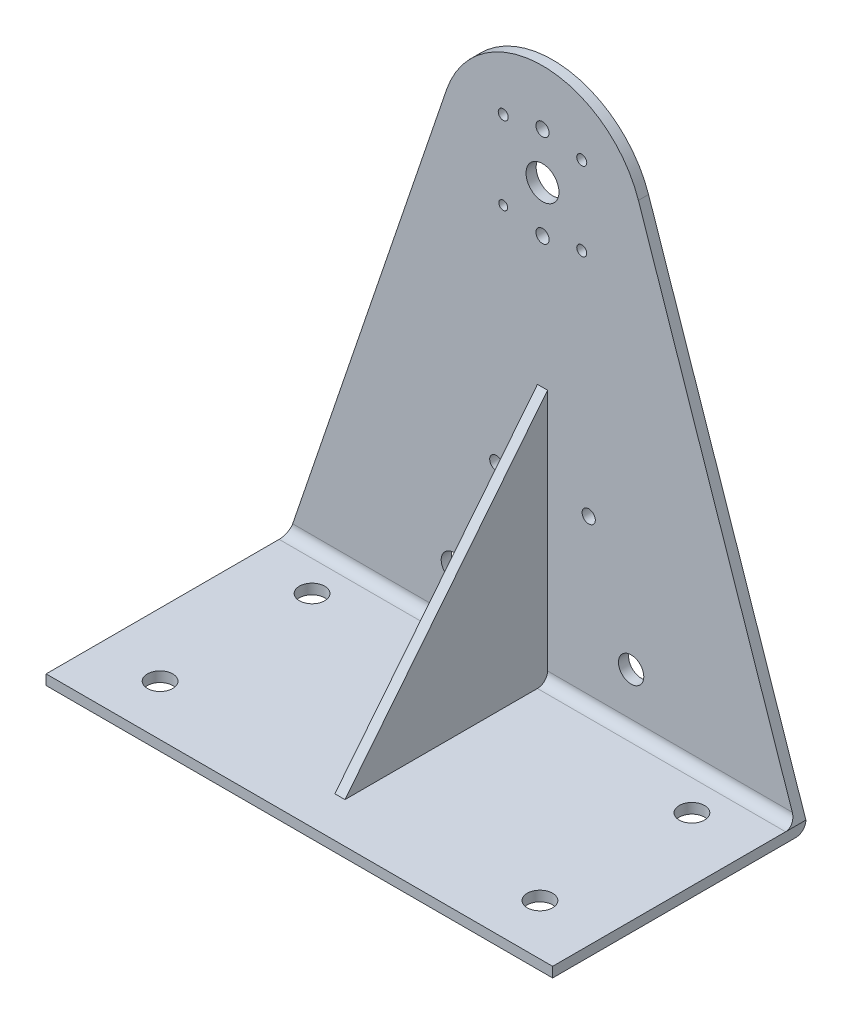
ISO-10303-21;
HEADER;
FILE_DESCRIPTION(('STEP AP214'),'2;1');
FILE_NAME('part.step','',(''),(''),'','','');
FILE_SCHEMA(('AUTOMOTIVE_DESIGN { 1 0 10303 214 1 1 1 1 }'));
ENDSEC;
DATA;
#1=APPLICATION_CONTEXT('core data for automotive mechanical design processes');
#2=APPLICATION_PROTOCOL_DEFINITION('international standard','automotive_design',2000,#1);
#3=PRODUCT_CONTEXT('',#1,'mechanical');
#4=PRODUCT('Part','Part','',(#3));
#5=PRODUCT_RELATED_PRODUCT_CATEGORY('part','',(#4));
#6=PRODUCT_DEFINITION_FORMATION('','',#4);
#7=PRODUCT_DEFINITION_CONTEXT('part definition',#1,'design');
#8=PRODUCT_DEFINITION('design','',#6,#7);
#9=PRODUCT_DEFINITION_SHAPE('','',#8);
#10=(LENGTH_UNIT() NAMED_UNIT(*) SI_UNIT(.MILLI.,.METRE.));
#11=(NAMED_UNIT(*) PLANE_ANGLE_UNIT() SI_UNIT($,.RADIAN.));
#12=(NAMED_UNIT(*) SI_UNIT($,.STERADIAN.) SOLID_ANGLE_UNIT());
#13=UNCERTAINTY_MEASURE_WITH_UNIT(LENGTH_MEASURE(1.E-05),#10,'distance_accuracy_value','');
#14=(GEOMETRIC_REPRESENTATION_CONTEXT(3) GLOBAL_UNCERTAINTY_ASSIGNED_CONTEXT((#13)) GLOBAL_UNIT_ASSIGNED_CONTEXT((#10,
#11,#12)) REPRESENTATION_CONTEXT('',''));
#15=CARTESIAN_POINT('',(0.,0.,0.));
#16=DIRECTION('',(0.,0.,1.));
#17=DIRECTION('',(1.,0.,0.));
#18=AXIS2_PLACEMENT_3D('',#15,#16,#17);
#19=CARTESIAN_POINT('',(100.,4.,8.00000000000001));
#20=DIRECTION('',(1.,0.,0.));
#21=DIRECTION('',(0.,0.,-1.));
#22=AXIS2_PLACEMENT_3D('',#19,#20,#21);
#23=CYLINDRICAL_SURFACE('',#22,4.);
#24=CARTESIAN_POINT('',(2.,4.,8.00000000000001));
#25=DIRECTION('',(-1.,0.,0.));
#26=DIRECTION('',(0.,0.,1.));
#27=AXIS2_PLACEMENT_3D('',#24,#25,#26);
#28=CIRCLE('',#27,4.);
#29=CARTESIAN_POINT('',(2.,0.,8.00000000000001));
#30=VERTEX_POINT('',#29);
#31=CARTESIAN_POINT('',(2.,4.,4.00000000000001));
#32=VERTEX_POINT('',#31);
#33=EDGE_CURVE('E119',#30,#32,#28,.F.);
#34=ORIENTED_EDGE('',*,*,#33,.F.);
#35=DIRECTION('',(-1.,0.,0.));
#36=VECTOR('',#35,1.);
#37=CARTESIAN_POINT('',(-100.,0.,8.00000000000001));
#38=LINE('',#37,#36);
#39=CARTESIAN_POINT('',(100.,0.,8.00000000000001));
#40=VERTEX_POINT('',#39);
#41=EDGE_CURVE('E207',#40,#30,#38,.T.);
#42=ORIENTED_EDGE('',*,*,#41,.F.);
#43=CARTESIAN_POINT('',(98.641067130598,4.,8.00000000000001));
#44=DIRECTION('',(-0.946849703262405,-0.321676296036708,0.));
#45=DIRECTION('',(0.321676296036708,-0.946849703262405,0.));
#46=AXIS2_PLACEMENT_3D('',#43,#44,#45);
#47=ELLIPSE('',#46,4.2245353050414,4.);
#48=CARTESIAN_POINT('',(98.641067130598,4.,4.));
#49=VERTEX_POINT('',#48);
#50=EDGE_CURVE('E204',#49,#40,#47,.T.);
#51=ORIENTED_EDGE('',*,*,#50,.F.);
#52=DIRECTION('',(-1.,0.,0.));
#53=VECTOR('',#52,1.);
#54=CARTESIAN_POINT('',(100.,4.,4.));
#55=LINE('',#54,#53);
#56=EDGE_CURVE('E199',#32,#49,#55,.F.);
#57=ORIENTED_EDGE('',*,*,#56,.F.);
#58=EDGE_LOOP('',(#34,#42,#51,#57));
#59=FACE_BOUND('',#58,.T.);
#60=ADVANCED_FACE('F110',(#59),#23,.F.);
#61=CARTESIAN_POINT('',(0.,0.,0.));
#62=DIRECTION('',(0.,0.,1.));
#63=DIRECTION('',(1.,0.,0.));
#64=AXIS2_PLACEMENT_3D('',#61,#62,#63);
#65=PLANE('',#64);
#66=CARTESIAN_POINT('',(-15.5,154.5,0.));
#67=DIRECTION('',(0.,0.,1.));
#68=DIRECTION('',(1.,0.,0.));
#69=AXIS2_PLACEMENT_3D('',#66,#67,#68);
#70=CIRCLE('',#69,1.75);
#71=CARTESIAN_POINT('',(-13.75,154.5,0.));
#72=VERTEX_POINT('',#71);
#73=EDGE_CURVE('E513',#72,#72,#70,.T.);
#74=ORIENTED_EDGE('',*,*,#73,.T.);
#75=EDGE_LOOP('',(#74));
#76=FACE_BOUND('',#75,.T.);
#77=CARTESIAN_POINT('',(15.5,154.5,0.));
#78=DIRECTION('',(0.,0.,1.));
#79=DIRECTION('',(1.,0.,0.));
#80=AXIS2_PLACEMENT_3D('',#77,#78,#79);
#81=CIRCLE('',#80,1.97872079457994);
#82=CARTESIAN_POINT('',(17.4787207945799,154.5,0.));
#83=VERTEX_POINT('',#82);
#84=EDGE_CURVE('E509',#83,#83,#81,.T.);
#85=ORIENTED_EDGE('',*,*,#84,.T.);
#86=EDGE_LOOP('',(#85));
#87=FACE_BOUND('',#86,.T.);
#88=CARTESIAN_POINT('',(15.5,185.5,0.));
#89=DIRECTION('',(0.,0.,1.));
#90=DIRECTION('',(1.,0.,0.));
#91=AXIS2_PLACEMENT_3D('',#88,#89,#90);
#92=CIRCLE('',#91,1.97872079457994);
#93=CARTESIAN_POINT('',(17.4787207945799,185.5,0.));
#94=VERTEX_POINT('',#93);
#95=EDGE_CURVE('E507',#94,#94,#92,.T.);
#96=ORIENTED_EDGE('',*,*,#95,.T.);
#97=EDGE_LOOP('',(#96));
#98=FACE_BOUND('',#97,.T.);
#99=CARTESIAN_POINT('',(-15.5,185.5,0.));
#100=DIRECTION('',(0.,0.,1.));
#101=DIRECTION('',(1.,0.,0.));
#102=AXIS2_PLACEMENT_3D('',#99,#100,#101);
#103=CIRCLE('',#102,1.97872079457994);
#104=CARTESIAN_POINT('',(-13.5212792054201,185.5,0.));
#105=VERTEX_POINT('',#104);
#106=EDGE_CURVE('E510',#105,#105,#103,.T.);
#107=ORIENTED_EDGE('',*,*,#106,.T.);
#108=EDGE_LOOP('',(#107));
#109=FACE_BOUND('',#108,.T.);
#110=CARTESIAN_POINT('',(-35.,21.,0.));
#111=DIRECTION('',(0.,0.,1.));
#112=DIRECTION('',(1.,0.,0.));
#113=AXIS2_PLACEMENT_3D('',#110,#111,#112);
#114=CIRCLE('',#113,5.);
#115=CARTESIAN_POINT('',(-30.,21.,0.));
#116=VERTEX_POINT('',#115);
#117=EDGE_CURVE('E237',#116,#116,#114,.T.);
#118=ORIENTED_EDGE('',*,*,#117,.T.);
#119=EDGE_LOOP('',(#118));
#120=FACE_BOUND('',#119,.T.);
#121=CARTESIAN_POINT('',(35.,21.,0.));
#122=DIRECTION('',(0.,0.,1.));
#123=DIRECTION('',(1.,0.,0.));
#124=AXIS2_PLACEMENT_3D('',#121,#122,#123);
#125=CIRCLE('',#124,5.);
#126=CARTESIAN_POINT('',(40.,21.,0.));
#127=VERTEX_POINT('',#126);
#128=EDGE_CURVE('E526',#127,#127,#125,.T.);
#129=ORIENTED_EDGE('',*,*,#128,.T.);
#130=EDGE_LOOP('',(#129));
#131=FACE_BOUND('',#130,.T.);
#132=CARTESIAN_POINT('',(18.25,65.,0.));
#133=DIRECTION('',(0.,0.,-1.));
#134=DIRECTION('',(-1.,0.,0.));
#135=AXIS2_PLACEMENT_3D('',#132,#133,#134);
#136=CIRCLE('',#135,2.6);
#137=CARTESIAN_POINT('',(15.65,65.,0.));
#138=VERTEX_POINT('',#137);
#139=EDGE_CURVE('E226',#138,#138,#136,.T.);
#140=ORIENTED_EDGE('',*,*,#139,.F.);
#141=EDGE_LOOP('',(#140));
#142=FACE_BOUND('',#141,.T.);
#143=CARTESIAN_POINT('',(-18.25,65.,0.));
#144=DIRECTION('',(0.,0.,-1.));
#145=DIRECTION('',(-1.,0.,0.));
#146=AXIS2_PLACEMENT_3D('',#143,#144,#145);
#147=CIRCLE('',#146,2.6);
#148=CARTESIAN_POINT('',(-20.85,65.,0.));
#149=VERTEX_POINT('',#148);
#150=EDGE_CURVE('E232',#149,#149,#147,.T.);
#151=ORIENTED_EDGE('',*,*,#150,.F.);
#152=EDGE_LOOP('',(#151));
#153=FACE_BOUND('',#152,.T.);
#154=DIRECTION('',(-1.,0.,0.));
#155=VECTOR('',#154,1.);
#156=CARTESIAN_POINT('',(-100.,0.,0.));
#157=LINE('',#156,#155);
#158=CARTESIAN_POINT('',(100.,0.,0.));
#159=VERTEX_POINT('',#158);
#160=CARTESIAN_POINT('',(-100.,0.,0.));
#161=VERTEX_POINT('',#160);
#162=EDGE_CURVE('E336',#159,#161,#157,.T.);
#163=ORIENTED_EDGE('',*,*,#162,.T.);
#164=DIRECTION('',(0.321676296036708,0.946849703262405,0.));
#165=VECTOR('',#164,1.);
#166=CARTESIAN_POINT('',(-89.6524360568104,30.4579105448907,0.));
#167=LINE('',#166,#165);
#168=CARTESIAN_POINT('',(-37.8739881304963,182.867051841468,0.));
#169=VERTEX_POINT('',#168);
#170=EDGE_CURVE('E306',#161,#169,#167,.T.);
#171=ORIENTED_EDGE('',*,*,#170,.T.);
#172=CARTESIAN_POINT('',(0.,170.,0.));
#173=DIRECTION('',(0.,0.,1.));
#174=DIRECTION('',(1.,0.,0.));
#175=AXIS2_PLACEMENT_3D('',#172,#173,#174);
#176=CIRCLE('',#175,40.);
#177=CARTESIAN_POINT('',(37.8739881304963,182.867051841468,0.));
#178=VERTEX_POINT('',#177);
#179=EDGE_CURVE('E321',#178,#169,#176,.T.);
#180=ORIENTED_EDGE('',*,*,#179,.F.);
#181=DIRECTION('',(-0.321676296036708,0.946849703262405,0.));
#182=VECTOR('',#181,1.);
#183=CARTESIAN_POINT('',(89.6524360568104,30.4579105448907,0.));
#184=LINE('',#183,#182);
#185=EDGE_CURVE('E317',#159,#178,#184,.T.);
#186=ORIENTED_EDGE('',*,*,#185,.F.);
#187=EDGE_LOOP('',(#163,#171,#180,#186));
#188=FACE_BOUND('',#187,.T.);
#189=CARTESIAN_POINT('',(0.,188.25,0.));
#190=DIRECTION('',(0.,0.,-1.));
#191=DIRECTION('',(-1.,0.,0.));
#192=AXIS2_PLACEMENT_3D('',#189,#190,#191);
#193=CIRCLE('',#192,2.6);
#194=CARTESIAN_POINT('',(-2.59999999999999,188.25,0.));
#195=VERTEX_POINT('',#194);
#196=EDGE_CURVE('E296',#195,#195,#193,.T.);
#197=ORIENTED_EDGE('',*,*,#196,.F.);
#198=EDGE_LOOP('',(#197));
#199=FACE_BOUND('',#198,.T.);
#200=CARTESIAN_POINT('',(0.,151.75,0.));
#201=DIRECTION('',(0.,0.,-1.));
#202=DIRECTION('',(-1.,0.,0.));
#203=AXIS2_PLACEMENT_3D('',#200,#201,#202);
#204=CIRCLE('',#203,2.59999999999999);
#205=CARTESIAN_POINT('',(-2.6,151.75,0.));
#206=VERTEX_POINT('',#205);
#207=EDGE_CURVE('E293',#206,#206,#204,.T.);
#208=ORIENTED_EDGE('',*,*,#207,.F.);
#209=EDGE_LOOP('',(#208));
#210=FACE_BOUND('',#209,.T.);
#211=CARTESIAN_POINT('',(0.,170.,0.));
#212=DIRECTION('',(0.,0.,1.));
#213=DIRECTION('',(1.,0.,0.));
#214=AXIS2_PLACEMENT_3D('',#211,#212,#213);
#215=CIRCLE('',#214,6.50000000000001);
#216=CARTESIAN_POINT('',(6.50000000000001,170.,0.));
#217=VERTEX_POINT('',#216);
#218=EDGE_CURVE('E314',#217,#217,#215,.T.);
#219=ORIENTED_EDGE('',*,*,#218,.T.);
#220=EDGE_LOOP('',(#219));
#221=FACE_BOUND('',#220,.T.);
#222=ADVANCED_FACE('F385',(#76,#87,#98,#109,#120,#131,#142,#153,#188,#199,#210,#221),#65,.F.);
#223=CARTESIAN_POINT('',(89.6524360568104,30.4579105448907,4.));
#224=DIRECTION('',(-0.946849703262405,-0.321676296036708,0.));
#225=DIRECTION('',(0.321676296036708,-0.946849703262405,0.));
#226=AXIS2_PLACEMENT_3D('',#223,#224,#225);
#227=PLANE('',#226);
#228=ORIENTED_EDGE('',*,*,#185,.T.);
#229=DIRECTION('',(0.,0.,-1.));
#230=VECTOR('',#229,1.);
#231=CARTESIAN_POINT('',(37.8739881304963,182.867051841468,4.));
#232=LINE('',#231,#230);
#233=CARTESIAN_POINT('',(37.8739881304963,182.867051841468,4.));
#234=VERTEX_POINT('',#233);
#235=EDGE_CURVE('E330',#234,#178,#232,.T.);
#236=ORIENTED_EDGE('',*,*,#235,.F.);
#237=DIRECTION('',(-0.321676296036708,0.946849703262405,0.));
#238=VECTOR('',#237,1.);
#239=CARTESIAN_POINT('',(89.6524360568104,30.4579105448907,4.));
#240=LINE('',#239,#238);
#241=EDGE_CURVE('E305',#49,#234,#240,.T.);
#242=ORIENTED_EDGE('',*,*,#241,.F.);
#243=ORIENTED_EDGE('',*,*,#50,.T.);
#244=DIRECTION('',(0.,0.,-1.));
#245=VECTOR('',#244,1.);
#246=CARTESIAN_POINT('',(100.,0.,4.));
#247=LINE('',#246,#245);
#248=EDGE_CURVE('E333',#40,#159,#247,.T.);
#249=ORIENTED_EDGE('',*,*,#248,.T.);
#250=EDGE_LOOP('',(#228,#236,#242,#243,#249));
#251=FACE_BOUND('',#250,.T.);
#252=ADVANCED_FACE('F379',(#251),#227,.F.);
#253=CARTESIAN_POINT('',(0.,170.,4.));
#254=DIRECTION('',(0.,0.,-1.));
#255=DIRECTION('',(-1.,0.,0.));
#256=AXIS2_PLACEMENT_3D('',#253,#254,#255);
#257=CYLINDRICAL_SURFACE('',#256,6.50000000000001);
#258=CARTESIAN_POINT('',(0.,170.,4.));
#259=DIRECTION('',(0.,0.,1.));
#260=DIRECTION('',(1.,0.,0.));
#261=AXIS2_PLACEMENT_3D('',#258,#259,#260);
#262=CIRCLE('',#261,6.50000000000001);
#263=CARTESIAN_POINT('',(6.50000000000001,170.,4.));
#264=VERTEX_POINT('',#263);
#265=EDGE_CURVE('E302',#264,#264,#262,.T.);
#266=ORIENTED_EDGE('',*,*,#265,.T.);
#267=EDGE_LOOP('',(#266));
#268=FACE_BOUND('',#267,.T.);
#269=ORIENTED_EDGE('',*,*,#218,.F.);
#270=EDGE_LOOP('',(#269));
#271=FACE_BOUND('',#270,.T.);
#272=ADVANCED_FACE('F423',(#268,#271),#257,.F.);
#273=CARTESIAN_POINT('',(0.,170.,4.));
#274=DIRECTION('',(0.,0.,-1.));
#275=DIRECTION('',(-1.,0.,0.));
#276=AXIS2_PLACEMENT_3D('',#273,#274,#275);
#277=CYLINDRICAL_SURFACE('',#276,40.);
#278=ORIENTED_EDGE('',*,*,#179,.T.);
#279=DIRECTION('',(0.,0.,-1.));
#280=VECTOR('',#279,1.);
#281=CARTESIAN_POINT('',(-37.8739881304963,182.867051841468,4.));
#282=LINE('',#281,#280);
#283=CARTESIAN_POINT('',(-37.8739881304963,182.867051841468,4.));
#284=VERTEX_POINT('',#283);
#285=EDGE_CURVE('E328',#284,#169,#282,.T.);
#286=ORIENTED_EDGE('',*,*,#285,.F.);
#287=CARTESIAN_POINT('',(0.,170.,4.));
#288=DIRECTION('',(0.,0.,1.));
#289=DIRECTION('',(1.,0.,0.));
#290=AXIS2_PLACEMENT_3D('',#287,#288,#289);
#291=CIRCLE('',#290,40.);
#292=EDGE_CURVE('E308',#234,#284,#291,.T.);
#293=ORIENTED_EDGE('',*,*,#292,.F.);
#294=ORIENTED_EDGE('',*,*,#235,.T.);
#295=EDGE_LOOP('',(#278,#286,#293,#294));
#296=FACE_BOUND('',#295,.T.);
#297=ADVANCED_FACE('F383',(#296),#277,.T.);
#298=CARTESIAN_POINT('',(-89.6524360568104,30.4579105448907,4.));
#299=DIRECTION('',(-0.946849703262405,0.321676296036708,0.));
#300=DIRECTION('',(-0.321676296036708,-0.946849703262405,0.));
#301=AXIS2_PLACEMENT_3D('',#298,#299,#300);
#302=PLANE('',#301);
#303=ORIENTED_EDGE('',*,*,#170,.F.);
#304=DIRECTION('',(0.,0.,-1.));
#305=VECTOR('',#304,1.);
#306=CARTESIAN_POINT('',(-100.,0.,4.));
#307=LINE('',#306,#305);
#308=CARTESIAN_POINT('',(-100.,0.,8.00000000000001));
#309=VERTEX_POINT('',#308);
#310=EDGE_CURVE('E313',#309,#161,#307,.T.);
#311=ORIENTED_EDGE('',*,*,#310,.F.);
#312=CARTESIAN_POINT('',(-98.641067130598,4.,8.00000000000001));
#313=DIRECTION('',(-0.946849703262405,0.321676296036708,0.));
#314=DIRECTION('',(0.321676296036708,0.946849703262405,0.));
#315=AXIS2_PLACEMENT_3D('',#312,#313,#314);
#316=ELLIPSE('',#315,4.2245353050414,4.);
#317=CARTESIAN_POINT('',(-98.641067130598,4.,4.));
#318=VERTEX_POINT('',#317);
#319=EDGE_CURVE('E221',#309,#318,#316,.F.);
#320=ORIENTED_EDGE('',*,*,#319,.T.);
#321=DIRECTION('',(0.321676296036708,0.946849703262405,0.));
#322=VECTOR('',#321,1.);
#323=CARTESIAN_POINT('',(-89.6524360568104,30.4579105448907,4.));
#324=LINE('',#323,#322);
#325=EDGE_CURVE('E311',#318,#284,#324,.T.);
#326=ORIENTED_EDGE('',*,*,#325,.T.);
#327=ORIENTED_EDGE('',*,*,#285,.T.);
#328=EDGE_LOOP('',(#303,#311,#320,#326,#327));
#329=FACE_BOUND('',#328,.T.);
#330=ADVANCED_FACE('F360',(#329),#302,.T.);
#331=CARTESIAN_POINT('',(0.,0.,4.));
#332=DIRECTION('',(0.,0.,1.));
#333=DIRECTION('',(1.,0.,0.));
#334=AXIS2_PLACEMENT_3D('',#331,#332,#333);
#335=PLANE('',#334);
#336=CARTESIAN_POINT('',(-15.5,154.5,4.));
#337=DIRECTION('',(0.,0.,1.));
#338=DIRECTION('',(1.,0.,0.));
#339=AXIS2_PLACEMENT_3D('',#336,#337,#338);
#340=CIRCLE('',#339,1.75);
#341=CARTESIAN_POINT('',(-13.75,154.5,4.));
#342=VERTEX_POINT('',#341);
#343=EDGE_CURVE('E557',#342,#342,#340,.T.);
#344=ORIENTED_EDGE('',*,*,#343,.F.);
#345=EDGE_LOOP('',(#344));
#346=FACE_BOUND('',#345,.T.);
#347=CARTESIAN_POINT('',(15.5,154.5,4.));
#348=DIRECTION('',(0.,0.,1.));
#349=DIRECTION('',(1.,0.,0.));
#350=AXIS2_PLACEMENT_3D('',#347,#348,#349);
#351=CIRCLE('',#350,1.97872079457994);
#352=CARTESIAN_POINT('',(17.4787207945799,154.5,4.));
#353=VERTEX_POINT('',#352);
#354=EDGE_CURVE('E560',#353,#353,#351,.T.);
#355=ORIENTED_EDGE('',*,*,#354,.F.);
#356=EDGE_LOOP('',(#355));
#357=FACE_BOUND('',#356,.T.);
#358=CARTESIAN_POINT('',(15.5,185.5,4.));
#359=DIRECTION('',(0.,0.,1.));
#360=DIRECTION('',(1.,0.,0.));
#361=AXIS2_PLACEMENT_3D('',#358,#359,#360);
#362=CIRCLE('',#361,1.97872079457994);
#363=CARTESIAN_POINT('',(17.4787207945799,185.5,4.));
#364=VERTEX_POINT('',#363);
#365=EDGE_CURVE('E504',#364,#364,#362,.T.);
#366=ORIENTED_EDGE('',*,*,#365,.F.);
#367=EDGE_LOOP('',(#366));
#368=FACE_BOUND('',#367,.T.);
#369=CARTESIAN_POINT('',(-15.5,185.5,4.));
#370=DIRECTION('',(0.,0.,1.));
#371=DIRECTION('',(1.,0.,0.));
#372=AXIS2_PLACEMENT_3D('',#369,#370,#371);
#373=CIRCLE('',#372,1.97872079457994);
#374=CARTESIAN_POINT('',(-13.5212792054201,185.5,4.));
#375=VERTEX_POINT('',#374);
#376=EDGE_CURVE('E516',#375,#375,#373,.T.);
#377=ORIENTED_EDGE('',*,*,#376,.F.);
#378=EDGE_LOOP('',(#377));
#379=FACE_BOUND('',#378,.T.);
#380=CARTESIAN_POINT('',(-35.,21.,4.));
#381=DIRECTION('',(0.,0.,1.));
#382=DIRECTION('',(1.,0.,0.));
#383=AXIS2_PLACEMENT_3D('',#380,#381,#382);
#384=CIRCLE('',#383,5.);
#385=CARTESIAN_POINT('',(-30.,21.,4.));
#386=VERTEX_POINT('',#385);
#387=EDGE_CURVE('E523',#386,#386,#384,.T.);
#388=ORIENTED_EDGE('',*,*,#387,.F.);
#389=EDGE_LOOP('',(#388));
#390=FACE_BOUND('',#389,.T.);
#391=CARTESIAN_POINT('',(35.,21.,4.));
#392=DIRECTION('',(0.,0.,1.));
#393=DIRECTION('',(-1.,0.,0.));
#394=AXIS2_PLACEMENT_3D('',#391,#392,#393);
#395=CIRCLE('',#394,5.);
#396=CARTESIAN_POINT('',(30.,21.,4.));
#397=VERTEX_POINT('',#396);
#398=EDGE_CURVE('E522',#397,#397,#395,.T.);
#399=ORIENTED_EDGE('',*,*,#398,.F.);
#400=EDGE_LOOP('',(#399));
#401=FACE_BOUND('',#400,.T.);
#402=CARTESIAN_POINT('',(18.25,65.,4.));
#403=DIRECTION('',(0.,0.,1.));
#404=DIRECTION('',(1.,0.,0.));
#405=AXIS2_PLACEMENT_3D('',#402,#403,#404);
#406=CIRCLE('',#405,2.6);
#407=CARTESIAN_POINT('',(20.85,65.,4.));
#408=VERTEX_POINT('',#407);
#409=EDGE_CURVE('E114',#408,#408,#406,.T.);
#410=ORIENTED_EDGE('',*,*,#409,.F.);
#411=EDGE_LOOP('',(#410));
#412=FACE_BOUND('',#411,.T.);
#413=CARTESIAN_POINT('',(-18.25,65.,4.));
#414=DIRECTION('',(0.,0.,1.));
#415=DIRECTION('',(1.,0.,0.));
#416=AXIS2_PLACEMENT_3D('',#413,#414,#415);
#417=CIRCLE('',#416,2.6);
#418=CARTESIAN_POINT('',(-15.65,65.,4.));
#419=VERTEX_POINT('',#418);
#420=EDGE_CURVE('E224',#419,#419,#417,.T.);
#421=ORIENTED_EDGE('',*,*,#420,.F.);
#422=EDGE_LOOP('',(#421));
#423=FACE_BOUND('',#422,.T.);
#424=DIRECTION('',(0.,-1.,0.));
#425=VECTOR('',#424,1.);
#426=CARTESIAN_POINT('',(-2.,0.,4.));
#427=LINE('',#426,#425);
#428=CARTESIAN_POINT('',(-2.,100.,4.));
#429=VERTEX_POINT('',#428);
#430=CARTESIAN_POINT('',(-2.,4.,4.));
#431=VERTEX_POINT('',#430);
#432=EDGE_CURVE('E127',#429,#431,#427,.T.);
#433=ORIENTED_EDGE('',*,*,#432,.F.);
#434=DIRECTION('',(-1.,0.,0.));
#435=VECTOR('',#434,1.);
#436=CARTESIAN_POINT('',(0.,100.,4.));
#437=LINE('',#436,#435);
#438=CARTESIAN_POINT('',(2.,100.,4.));
#439=VERTEX_POINT('',#438);
#440=EDGE_CURVE('E131',#439,#429,#437,.T.);
#441=ORIENTED_EDGE('',*,*,#440,.F.);
#442=DIRECTION('',(0.,-1.,0.));
#443=VECTOR('',#442,1.);
#444=CARTESIAN_POINT('',(2.,0.,4.));
#445=LINE('',#444,#443);
#446=EDGE_CURVE('E209',#439,#32,#445,.T.);
#447=ORIENTED_EDGE('',*,*,#446,.T.);
#448=ORIENTED_EDGE('',*,*,#56,.T.);
#449=ORIENTED_EDGE('',*,*,#241,.T.);
#450=ORIENTED_EDGE('',*,*,#292,.T.);
#451=ORIENTED_EDGE('',*,*,#325,.F.);
#452=EDGE_CURVE('E206',#318,#431,#55,.F.);
#453=ORIENTED_EDGE('',*,*,#452,.T.);
#454=EDGE_LOOP('',(#433,#441,#447,#448,#449,#450,#451,#453));
#455=FACE_BOUND('',#454,.T.);
#456=CARTESIAN_POINT('',(0.,188.25,4.));
#457=DIRECTION('',(0.,0.,1.));
#458=DIRECTION('',(1.,0.,0.));
#459=AXIS2_PLACEMENT_3D('',#456,#457,#458);
#460=CIRCLE('',#459,2.6);
#461=CARTESIAN_POINT('',(2.6,188.25,4.));
#462=VERTEX_POINT('',#461);
#463=EDGE_CURVE('E342',#462,#462,#460,.T.);
#464=ORIENTED_EDGE('',*,*,#463,.F.);
#465=EDGE_LOOP('',(#464));
#466=FACE_BOUND('',#465,.T.);
#467=CARTESIAN_POINT('',(0.,151.75,4.));
#468=DIRECTION('',(0.,0.,1.));
#469=DIRECTION('',(1.,0.,0.));
#470=AXIS2_PLACEMENT_3D('',#467,#468,#469);
#471=CIRCLE('',#470,2.59999999999999);
#472=CARTESIAN_POINT('',(2.59999999999999,151.75,4.));
#473=VERTEX_POINT('',#472);
#474=EDGE_CURVE('E299',#473,#473,#471,.T.);
#475=ORIENTED_EDGE('',*,*,#474,.F.);
#476=EDGE_LOOP('',(#475));
#477=FACE_BOUND('',#476,.T.);
#478=ORIENTED_EDGE('',*,*,#265,.F.);
#479=EDGE_LOOP('',(#478));
#480=FACE_BOUND('',#479,.T.);
#481=ADVANCED_FACE('F210',(#346,#357,#368,#379,#390,#401,#412,#423,#455,#466,#477,#480),#335,.T.);
#482=CARTESIAN_POINT('',(100.,0.,4.));
#483=DIRECTION('',(1.,0.,0.));
#484=DIRECTION('',(0.,0.,-1.));
#485=AXIS2_PLACEMENT_3D('',#482,#483,#484);
#486=PLANE('',#485);
#487=DIRECTION('',(0.,0.,-1.));
#488=VECTOR('',#487,1.);
#489=CARTESIAN_POINT('',(100.,-3.99999999999996,4.));
#490=LINE('',#489,#488);
#491=CARTESIAN_POINT('',(100.,-3.99999999999996,100.));
#492=VERTEX_POINT('',#491);
#493=CARTESIAN_POINT('',(100.,-3.99999999999996,4.));
#494=VERTEX_POINT('',#493);
#495=EDGE_CURVE('E318',#492,#494,#490,.T.);
#496=ORIENTED_EDGE('',*,*,#495,.T.);
#497=CARTESIAN_POINT('',(100.,0.,4.));
#498=DIRECTION('',(1.,0.,0.));
#499=DIRECTION('',(0.,0.,-1.));
#500=AXIS2_PLACEMENT_3D('',#497,#498,#499);
#501=CIRCLE('',#500,4.);
#502=EDGE_CURVE('E352',#494,#159,#501,.T.);
#503=ORIENTED_EDGE('',*,*,#502,.T.);
#504=ORIENTED_EDGE('',*,*,#248,.F.);
#505=DIRECTION('',(0.,0.,-1.));
#506=VECTOR('',#505,1.);
#507=CARTESIAN_POINT('',(100.,0.,100.));
#508=LINE('',#507,#506);
#509=CARTESIAN_POINT('',(100.,0.,100.));
#510=VERTEX_POINT('',#509);
#511=EDGE_CURVE('E290',#510,#40,#508,.T.);
#512=ORIENTED_EDGE('',*,*,#511,.F.);
#513=DIRECTION('',(0.,-1.,0.));
#514=VECTOR('',#513,1.);
#515=CARTESIAN_POINT('',(100.,0.,100.));
#516=LINE('',#515,#514);
#517=EDGE_CURVE('E277',#510,#492,#516,.T.);
#518=ORIENTED_EDGE('',*,*,#517,.T.);
#519=EDGE_LOOP('',(#496,#503,#504,#512,#518));
#520=FACE_BOUND('',#519,.T.);
#521=ADVANCED_FACE('F399',(#520),#486,.T.);
#522=CARTESIAN_POINT('',(-100.,0.,4.));
#523=DIRECTION('',(1.,0.,0.));
#524=DIRECTION('',(0.,0.,-1.));
#525=AXIS2_PLACEMENT_3D('',#522,#523,#524);
#526=PLANE('',#525);
#527=ORIENTED_EDGE('',*,*,#310,.T.);
#528=CARTESIAN_POINT('',(-100.,0.,4.));
#529=DIRECTION('',(1.,0.,0.));
#530=DIRECTION('',(0.,0.,-1.));
#531=AXIS2_PLACEMENT_3D('',#528,#529,#530);
#532=CIRCLE('',#531,4.);
#533=CARTESIAN_POINT('',(-100.,-4.00000000000002,4.));
#534=VERTEX_POINT('',#533);
#535=EDGE_CURVE('E348',#161,#534,#532,.F.);
#536=ORIENTED_EDGE('',*,*,#535,.T.);
#537=DIRECTION('',(0.,0.,-1.));
#538=VECTOR('',#537,1.);
#539=CARTESIAN_POINT('',(-100.,-4.00000000000002,4.));
#540=LINE('',#539,#538);
#541=CARTESIAN_POINT('',(-100.,-4.00000000000002,100.));
#542=VERTEX_POINT('',#541);
#543=EDGE_CURVE('E339',#542,#534,#540,.T.);
#544=ORIENTED_EDGE('',*,*,#543,.F.);
#545=DIRECTION('',(0.,1.,0.));
#546=VECTOR('',#545,1.);
#547=CARTESIAN_POINT('',(-100.,0.,100.));
#548=LINE('',#547,#546);
#549=CARTESIAN_POINT('',(-100.,0.,100.));
#550=VERTEX_POINT('',#549);
#551=EDGE_CURVE('E283',#542,#550,#548,.T.);
#552=ORIENTED_EDGE('',*,*,#551,.T.);
#553=DIRECTION('',(0.,0.,-1.));
#554=VECTOR('',#553,1.);
#555=CARTESIAN_POINT('',(-100.,0.,100.));
#556=LINE('',#555,#554);
#557=EDGE_CURVE('E289',#550,#309,#556,.T.);
#558=ORIENTED_EDGE('',*,*,#557,.T.);
#559=EDGE_LOOP('',(#527,#536,#544,#552,#558));
#560=FACE_BOUND('',#559,.T.);
#561=ADVANCED_FACE('F394',(#560),#526,.F.);
#562=CARTESIAN_POINT('',(100.,-3.99999999999996,4.));
#563=DIRECTION('',(0.,-1.,0.));
#564=DIRECTION('',(1.,0.,0.));
#565=AXIS2_PLACEMENT_3D('',#562,#563,#564);
#566=PLANE('',#565);
#567=CARTESIAN_POINT('',(-75.,-4.00000000000002,20.));
#568=DIRECTION('',(0.,-1.,0.));
#569=DIRECTION('',(1.,0.,0.));
#570=AXIS2_PLACEMENT_3D('',#567,#568,#569);
#571=CIRCLE('',#570,5.);
#572=CARTESIAN_POINT('',(-70.,-4.00000000000002,20.));
#573=VERTEX_POINT('',#572);
#574=EDGE_CURVE('E262',#573,#573,#571,.T.);
#575=ORIENTED_EDGE('',*,*,#574,.F.);
#576=EDGE_LOOP('',(#575));
#577=FACE_BOUND('',#576,.T.);
#578=CARTESIAN_POINT('',(75.,-3.99999999999998,80.));
#579=DIRECTION('',(0.,-1.,0.));
#580=DIRECTION('',(1.,0.,0.));
#581=AXIS2_PLACEMENT_3D('',#578,#579,#580);
#582=CIRCLE('',#581,5.00000000000001);
#583=CARTESIAN_POINT('',(80.,-3.99999999999997,80.));
#584=VERTEX_POINT('',#583);
#585=EDGE_CURVE('E259',#584,#584,#582,.T.);
#586=ORIENTED_EDGE('',*,*,#585,.F.);
#587=EDGE_LOOP('',(#586));
#588=FACE_BOUND('',#587,.T.);
#589=CARTESIAN_POINT('',(75.,-3.99999999999998,20.));
#590=DIRECTION('',(0.,-1.,0.));
#591=DIRECTION('',(1.,0.,0.));
#592=AXIS2_PLACEMENT_3D('',#589,#590,#591);
#593=CIRCLE('',#592,5.);
#594=CARTESIAN_POINT('',(80.,-3.99999999999997,20.));
#595=VERTEX_POINT('',#594);
#596=EDGE_CURVE('E256',#595,#595,#593,.T.);
#597=ORIENTED_EDGE('',*,*,#596,.F.);
#598=EDGE_LOOP('',(#597));
#599=FACE_BOUND('',#598,.T.);
#600=CARTESIAN_POINT('',(-75.,-4.00000000000002,80.));
#601=DIRECTION('',(0.,-1.,0.));
#602=DIRECTION('',(1.,0.,0.));
#603=AXIS2_PLACEMENT_3D('',#600,#601,#602);
#604=CIRCLE('',#603,5.00000000000001);
#605=CARTESIAN_POINT('',(-70.,-4.00000000000002,80.));
#606=VERTEX_POINT('',#605);
#607=EDGE_CURVE('E253',#606,#606,#604,.T.);
#608=ORIENTED_EDGE('',*,*,#607,.F.);
#609=EDGE_LOOP('',(#608));
#610=FACE_BOUND('',#609,.T.);
#611=ORIENTED_EDGE('',*,*,#543,.T.);
#612=DIRECTION('',(-1.,0.,0.));
#613=VECTOR('',#612,1.);
#614=CARTESIAN_POINT('',(100.,-3.99999999999996,4.));
#615=LINE('',#614,#613);
#616=EDGE_CURVE('E350',#534,#494,#615,.F.);
#617=ORIENTED_EDGE('',*,*,#616,.T.);
#618=ORIENTED_EDGE('',*,*,#495,.F.);
#619=DIRECTION('',(-1.,0.,0.));
#620=VECTOR('',#619,1.);
#621=CARTESIAN_POINT('',(100.,-3.99999999999996,100.));
#622=LINE('',#621,#620);
#623=EDGE_CURVE('E280',#492,#542,#622,.T.);
#624=ORIENTED_EDGE('',*,*,#623,.T.);
#625=EDGE_LOOP('',(#611,#617,#618,#624));
#626=FACE_BOUND('',#625,.T.);
#627=ADVANCED_FACE('F401',(#577,#588,#599,#610,#626),#566,.T.);
#628=CARTESIAN_POINT('',(0.,151.75,10.));
#629=DIRECTION('',(0.,0.,-1.));
#630=DIRECTION('',(-1.,0.,0.));
#631=AXIS2_PLACEMENT_3D('',#628,#629,#630);
#632=CYLINDRICAL_SURFACE('',#631,2.59999999999999);
#633=ORIENTED_EDGE('',*,*,#474,.T.);
#634=EDGE_LOOP('',(#633));
#635=FACE_BOUND('',#634,.T.);
#636=ORIENTED_EDGE('',*,*,#207,.T.);
#637=EDGE_LOOP('',(#636));
#638=FACE_BOUND('',#637,.T.);
#639=ADVANCED_FACE('F403',(#635,#638),#632,.F.);
#640=CARTESIAN_POINT('',(0.,188.25,10.));
#641=DIRECTION('',(0.,0.,-1.));
#642=DIRECTION('',(-1.,0.,0.));
#643=AXIS2_PLACEMENT_3D('',#640,#641,#642);
#644=CYLINDRICAL_SURFACE('',#643,2.6);
#645=ORIENTED_EDGE('',*,*,#463,.T.);
#646=EDGE_LOOP('',(#645));
#647=FACE_BOUND('',#646,.T.);
#648=ORIENTED_EDGE('',*,*,#196,.T.);
#649=EDGE_LOOP('',(#648));
#650=FACE_BOUND('',#649,.T.);
#651=ADVANCED_FACE('F409',(#647,#650),#644,.F.);
#652=CARTESIAN_POINT('',(100.,0.,100.));
#653=DIRECTION('',(0.,1.,0.));
#654=DIRECTION('',(0.,0.,1.));
#655=AXIS2_PLACEMENT_3D('',#652,#653,#654);
#656=PLANE('',#655);
#657=CARTESIAN_POINT('',(-75.,0.,20.));
#658=DIRECTION('',(0.,1.,0.));
#659=DIRECTION('',(0.,0.,1.));
#660=AXIS2_PLACEMENT_3D('',#657,#658,#659);
#661=CIRCLE('',#660,5.);
#662=CARTESIAN_POINT('',(-75.,0.,25.));
#663=VERTEX_POINT('',#662);
#664=EDGE_CURVE('E245',#663,#663,#661,.T.);
#665=ORIENTED_EDGE('',*,*,#664,.F.);
#666=EDGE_LOOP('',(#665));
#667=FACE_BOUND('',#666,.T.);
#668=CARTESIAN_POINT('',(75.,0.,80.));
#669=DIRECTION('',(0.,1.,0.));
#670=DIRECTION('',(0.,0.,1.));
#671=AXIS2_PLACEMENT_3D('',#668,#669,#670);
#672=CIRCLE('',#671,5.00000000000001);
#673=CARTESIAN_POINT('',(75.,0.,85.));
#674=VERTEX_POINT('',#673);
#675=EDGE_CURVE('E244',#674,#674,#672,.T.);
#676=ORIENTED_EDGE('',*,*,#675,.F.);
#677=EDGE_LOOP('',(#676));
#678=FACE_BOUND('',#677,.T.);
#679=CARTESIAN_POINT('',(75.,0.,20.));
#680=DIRECTION('',(0.,1.,0.));
#681=DIRECTION('',(0.,0.,1.));
#682=AXIS2_PLACEMENT_3D('',#679,#680,#681);
#683=CIRCLE('',#682,5.);
#684=CARTESIAN_POINT('',(75.,0.,25.));
#685=VERTEX_POINT('',#684);
#686=EDGE_CURVE('E230',#685,#685,#683,.T.);
#687=ORIENTED_EDGE('',*,*,#686,.F.);
#688=EDGE_LOOP('',(#687));
#689=FACE_BOUND('',#688,.T.);
#690=CARTESIAN_POINT('',(-75.,0.,80.));
#691=DIRECTION('',(0.,1.,0.));
#692=DIRECTION('',(0.,0.,1.));
#693=AXIS2_PLACEMENT_3D('',#690,#691,#692);
#694=CIRCLE('',#693,5.00000000000001);
#695=CARTESIAN_POINT('',(-75.,0.,85.));
#696=VERTEX_POINT('',#695);
#697=EDGE_CURVE('E248',#696,#696,#694,.T.);
#698=ORIENTED_EDGE('',*,*,#697,.F.);
#699=EDGE_LOOP('',(#698));
#700=FACE_BOUND('',#699,.T.);
#701=DIRECTION('',(0.,0.,1.));
#702=VECTOR('',#701,1.);
#703=CARTESIAN_POINT('',(-2.,0.,50.));
#704=LINE('',#703,#702);
#705=CARTESIAN_POINT('',(-2.,0.,8.00000000000001));
#706=VERTEX_POINT('',#705);
#707=CARTESIAN_POINT('',(-2.,0.,84.));
#708=VERTEX_POINT('',#707);
#709=EDGE_CURVE('E265',#706,#708,#704,.T.);
#710=ORIENTED_EDGE('',*,*,#709,.F.);
#711=EDGE_CURVE('E354',#706,#309,#38,.T.);
#712=ORIENTED_EDGE('',*,*,#711,.T.);
#713=ORIENTED_EDGE('',*,*,#557,.F.);
#714=DIRECTION('',(1.,0.,0.));
#715=VECTOR('',#714,1.);
#716=CARTESIAN_POINT('',(100.,0.,100.));
#717=LINE('',#716,#715);
#718=EDGE_CURVE('E286',#550,#510,#717,.T.);
#719=ORIENTED_EDGE('',*,*,#718,.T.);
#720=ORIENTED_EDGE('',*,*,#511,.T.);
#721=ORIENTED_EDGE('',*,*,#41,.T.);
#722=DIRECTION('',(0.,0.,1.));
#723=VECTOR('',#722,1.);
#724=CARTESIAN_POINT('',(2.,0.,50.));
#725=LINE('',#724,#723);
#726=CARTESIAN_POINT('',(2.,0.,84.));
#727=VERTEX_POINT('',#726);
#728=EDGE_CURVE('E219',#30,#727,#725,.T.);
#729=ORIENTED_EDGE('',*,*,#728,.T.);
#730=DIRECTION('',(-1.,0.,0.));
#731=VECTOR('',#730,1.);
#732=CARTESIAN_POINT('',(0.,0.,84.));
#733=LINE('',#732,#731);
#734=EDGE_CURVE('E215',#727,#708,#733,.T.);
#735=ORIENTED_EDGE('',*,*,#734,.T.);
#736=EDGE_LOOP('',(#710,#712,#713,#719,#720,#721,#729,#735));
#737=FACE_BOUND('',#736,.T.);
#738=ADVANCED_FACE('F374',(#667,#678,#689,#700,#737),#656,.T.);
#739=CARTESIAN_POINT('',(0.,0.,100.));
#740=DIRECTION('',(0.,0.,-1.));
#741=DIRECTION('',(-1.,0.,0.));
#742=AXIS2_PLACEMENT_3D('',#739,#740,#741);
#743=PLANE('',#742);
#744=ORIENTED_EDGE('',*,*,#517,.F.);
#745=ORIENTED_EDGE('',*,*,#718,.F.);
#746=ORIENTED_EDGE('',*,*,#551,.F.);
#747=ORIENTED_EDGE('',*,*,#623,.F.);
#748=EDGE_LOOP('',(#744,#745,#746,#747));
#749=FACE_BOUND('',#748,.T.);
#750=ADVANCED_FACE('F398',(#749),#743,.F.);
#751=CARTESIAN_POINT('',(0.,0.,4.));
#752=DIRECTION('',(1.,0.,0.));
#753=DIRECTION('',(0.,1.,0.));
#754=AXIS2_PLACEMENT_3D('',#751,#752,#753);
#755=CYLINDRICAL_SURFACE('',#754,4.);
#756=ORIENTED_EDGE('',*,*,#502,.F.);
#757=ORIENTED_EDGE('',*,*,#616,.F.);
#758=ORIENTED_EDGE('',*,*,#535,.F.);
#759=ORIENTED_EDGE('',*,*,#162,.F.);
#760=EDGE_LOOP('',(#756,#757,#758,#759));
#761=FACE_BOUND('',#760,.T.);
#762=ADVANCED_FACE('F392',(#761),#755,.T.);
#763=ORIENTED_EDGE('',*,*,#711,.F.);
#764=CARTESIAN_POINT('',(-2.,4.,8.00000000000001));
#765=DIRECTION('',(-1.,0.,0.));
#766=DIRECTION('',(0.,0.,1.));
#767=AXIS2_PLACEMENT_3D('',#764,#765,#766);
#768=CIRCLE('',#767,4.);
#769=EDGE_CURVE('E14',#706,#431,#768,.F.);
#770=ORIENTED_EDGE('',*,*,#769,.T.);
#771=ORIENTED_EDGE('',*,*,#452,.F.);
#772=ORIENTED_EDGE('',*,*,#319,.F.);
#773=EDGE_LOOP('',(#763,#770,#771,#772));
#774=FACE_BOUND('',#773,.T.);
#775=ADVANCED_FACE('F112',(#774),#23,.F.);
#776=CARTESIAN_POINT('',(0.,0.,84.));
#777=DIRECTION('',(0.,0.624695047554424,0.78086880944303));
#778=DIRECTION('',(0.,0.78086880944303,-0.624695047554424));
#779=AXIS2_PLACEMENT_3D('',#776,#777,#778);
#780=PLANE('',#779);
#781=DIRECTION('',(0.,0.78086880944303,-0.624695047554424));
#782=VECTOR('',#781,1.);
#783=CARTESIAN_POINT('',(2.,0.,84.));
#784=LINE('',#783,#782);
#785=EDGE_CURVE('E269',#727,#439,#784,.T.);
#786=ORIENTED_EDGE('',*,*,#785,.T.);
#787=ORIENTED_EDGE('',*,*,#440,.T.);
#788=DIRECTION('',(0.,0.78086880944303,-0.624695047554424));
#789=VECTOR('',#788,1.);
#790=CARTESIAN_POINT('',(-2.,0.,84.));
#791=LINE('',#790,#789);
#792=EDGE_CURVE('E268',#708,#429,#791,.T.);
#793=ORIENTED_EDGE('',*,*,#792,.F.);
#794=ORIENTED_EDGE('',*,*,#734,.F.);
#795=EDGE_LOOP('',(#786,#787,#793,#794));
#796=FACE_BOUND('',#795,.T.);
#797=ADVANCED_FACE('F372',(#796),#780,.T.);
#798=CARTESIAN_POINT('',(-2.,103.,50.));
#799=DIRECTION('',(-1.,0.,0.));
#800=DIRECTION('',(0.,0.,1.));
#801=AXIS2_PLACEMENT_3D('',#798,#799,#800);
#802=PLANE('',#801);
#803=ORIENTED_EDGE('',*,*,#792,.T.);
#804=ORIENTED_EDGE('',*,*,#432,.T.);
#805=ORIENTED_EDGE('',*,*,#769,.F.);
#806=ORIENTED_EDGE('',*,*,#709,.T.);
#807=EDGE_LOOP('',(#803,#804,#805,#806));
#808=FACE_BOUND('',#807,.T.);
#809=ADVANCED_FACE('F368',(#808),#802,.T.);
#810=CARTESIAN_POINT('',(2.,103.,50.));
#811=DIRECTION('',(-1.,0.,0.));
#812=DIRECTION('',(0.,0.,1.));
#813=AXIS2_PLACEMENT_3D('',#810,#811,#812);
#814=PLANE('',#813);
#815=ORIENTED_EDGE('',*,*,#446,.F.);
#816=ORIENTED_EDGE('',*,*,#785,.F.);
#817=ORIENTED_EDGE('',*,*,#728,.F.);
#818=ORIENTED_EDGE('',*,*,#33,.T.);
#819=EDGE_LOOP('',(#815,#816,#817,#818));
#820=FACE_BOUND('',#819,.T.);
#821=ADVANCED_FACE('F218',(#820),#814,.F.);
#822=CARTESIAN_POINT('',(-75.,-100.,80.));
#823=DIRECTION('',(0.,1.,0.));
#824=DIRECTION('',(0.,0.,1.));
#825=AXIS2_PLACEMENT_3D('',#822,#823,#824);
#826=CYLINDRICAL_SURFACE('',#825,5.00000000000001);
#827=ORIENTED_EDGE('',*,*,#607,.T.);
#828=EDGE_LOOP('',(#827));
#829=FACE_BOUND('',#828,.T.);
#830=ORIENTED_EDGE('',*,*,#697,.T.);
#831=EDGE_LOOP('',(#830));
#832=FACE_BOUND('',#831,.T.);
#833=ADVANCED_FACE('F452',(#829,#832),#826,.F.);
#834=CARTESIAN_POINT('',(75.,-100.,20.));
#835=DIRECTION('',(0.,1.,0.));
#836=DIRECTION('',(0.,0.,1.));
#837=AXIS2_PLACEMENT_3D('',#834,#835,#836);
#838=CYLINDRICAL_SURFACE('',#837,5.);
#839=ORIENTED_EDGE('',*,*,#596,.T.);
#840=EDGE_LOOP('',(#839));
#841=FACE_BOUND('',#840,.T.);
#842=ORIENTED_EDGE('',*,*,#686,.T.);
#843=EDGE_LOOP('',(#842));
#844=FACE_BOUND('',#843,.T.);
#845=ADVANCED_FACE('F457',(#841,#844),#838,.F.);
#846=CARTESIAN_POINT('',(75.,-100.,80.));
#847=DIRECTION('',(0.,1.,0.));
#848=DIRECTION('',(0.,0.,1.));
#849=AXIS2_PLACEMENT_3D('',#846,#847,#848);
#850=CYLINDRICAL_SURFACE('',#849,5.00000000000001);
#851=ORIENTED_EDGE('',*,*,#585,.T.);
#852=EDGE_LOOP('',(#851));
#853=FACE_BOUND('',#852,.T.);
#854=ORIENTED_EDGE('',*,*,#675,.T.);
#855=EDGE_LOOP('',(#854));
#856=FACE_BOUND('',#855,.T.);
#857=ADVANCED_FACE('F459',(#853,#856),#850,.F.);
#858=CARTESIAN_POINT('',(-75.,-100.,20.));
#859=DIRECTION('',(0.,1.,0.));
#860=DIRECTION('',(0.,0.,1.));
#861=AXIS2_PLACEMENT_3D('',#858,#859,#860);
#862=CYLINDRICAL_SURFACE('',#861,5.);
#863=ORIENTED_EDGE('',*,*,#574,.T.);
#864=EDGE_LOOP('',(#863));
#865=FACE_BOUND('',#864,.T.);
#866=ORIENTED_EDGE('',*,*,#664,.T.);
#867=EDGE_LOOP('',(#866));
#868=FACE_BOUND('',#867,.T.);
#869=ADVANCED_FACE('F462',(#865,#868),#862,.F.);
#870=CARTESIAN_POINT('',(-18.25,65.,40.));
#871=DIRECTION('',(0.,0.,-1.));
#872=DIRECTION('',(-1.,0.,0.));
#873=AXIS2_PLACEMENT_3D('',#870,#871,#872);
#874=CYLINDRICAL_SURFACE('',#873,2.6);
#875=ORIENTED_EDGE('',*,*,#420,.T.);
#876=EDGE_LOOP('',(#875));
#877=FACE_BOUND('',#876,.T.);
#878=ORIENTED_EDGE('',*,*,#150,.T.);
#879=EDGE_LOOP('',(#878));
#880=FACE_BOUND('',#879,.T.);
#881=ADVANCED_FACE('F466',(#877,#880),#874,.F.);
#882=CARTESIAN_POINT('',(18.25,65.,40.));
#883=DIRECTION('',(0.,0.,-1.));
#884=DIRECTION('',(-1.,0.,0.));
#885=AXIS2_PLACEMENT_3D('',#882,#883,#884);
#886=CYLINDRICAL_SURFACE('',#885,2.6);
#887=ORIENTED_EDGE('',*,*,#409,.T.);
#888=EDGE_LOOP('',(#887));
#889=FACE_BOUND('',#888,.T.);
#890=ORIENTED_EDGE('',*,*,#139,.T.);
#891=EDGE_LOOP('',(#890));
#892=FACE_BOUND('',#891,.T.);
#893=ADVANCED_FACE('F473',(#889,#892),#886,.F.);
#894=CARTESIAN_POINT('',(35.,21.,-6.));
#895=DIRECTION('',(0.,0.,1.));
#896=DIRECTION('',(1.,0.,0.));
#897=AXIS2_PLACEMENT_3D('',#894,#895,#896);
#898=CYLINDRICAL_SURFACE('',#897,5.);
#899=ORIENTED_EDGE('',*,*,#398,.T.);
#900=EDGE_LOOP('',(#899));
#901=FACE_BOUND('',#900,.T.);
#902=ORIENTED_EDGE('',*,*,#128,.F.);
#903=EDGE_LOOP('',(#902));
#904=FACE_BOUND('',#903,.T.);
#905=ADVANCED_FACE('F476',(#901,#904),#898,.F.);
#906=CARTESIAN_POINT('',(-35.,21.,-6.));
#907=DIRECTION('',(0.,0.,1.));
#908=DIRECTION('',(1.,0.,0.));
#909=AXIS2_PLACEMENT_3D('',#906,#907,#908);
#910=CYLINDRICAL_SURFACE('',#909,5.);
#911=ORIENTED_EDGE('',*,*,#387,.T.);
#912=EDGE_LOOP('',(#911));
#913=FACE_BOUND('',#912,.T.);
#914=ORIENTED_EDGE('',*,*,#117,.F.);
#915=EDGE_LOOP('',(#914));
#916=FACE_BOUND('',#915,.T.);
#917=ADVANCED_FACE('F480',(#913,#916),#910,.F.);
#918=CARTESIAN_POINT('',(-15.5,185.5,-6.));
#919=DIRECTION('',(0.,0.,1.));
#920=DIRECTION('',(1.,0.,0.));
#921=AXIS2_PLACEMENT_3D('',#918,#919,#920);
#922=CYLINDRICAL_SURFACE('',#921,1.97872079457994);
#923=ORIENTED_EDGE('',*,*,#376,.T.);
#924=EDGE_LOOP('',(#923));
#925=FACE_BOUND('',#924,.T.);
#926=ORIENTED_EDGE('',*,*,#106,.F.);
#927=EDGE_LOOP('',(#926));
#928=FACE_BOUND('',#927,.T.);
#929=ADVANCED_FACE('F484',(#925,#928),#922,.F.);
#930=CARTESIAN_POINT('',(15.5,185.5,-6.));
#931=DIRECTION('',(0.,0.,1.));
#932=DIRECTION('',(1.,0.,0.));
#933=AXIS2_PLACEMENT_3D('',#930,#931,#932);
#934=CYLINDRICAL_SURFACE('',#933,1.97872079457994);
#935=ORIENTED_EDGE('',*,*,#365,.T.);
#936=EDGE_LOOP('',(#935));
#937=FACE_BOUND('',#936,.T.);
#938=ORIENTED_EDGE('',*,*,#95,.F.);
#939=EDGE_LOOP('',(#938));
#940=FACE_BOUND('',#939,.T.);
#941=ADVANCED_FACE('F488',(#937,#940),#934,.F.);
#942=CARTESIAN_POINT('',(15.5,154.5,-6.));
#943=DIRECTION('',(0.,0.,1.));
#944=DIRECTION('',(1.,0.,0.));
#945=AXIS2_PLACEMENT_3D('',#942,#943,#944);
#946=CYLINDRICAL_SURFACE('',#945,1.97872079457994);
#947=ORIENTED_EDGE('',*,*,#354,.T.);
#948=EDGE_LOOP('',(#947));
#949=FACE_BOUND('',#948,.T.);
#950=ORIENTED_EDGE('',*,*,#84,.F.);
#951=EDGE_LOOP('',(#950));
#952=FACE_BOUND('',#951,.T.);
#953=ADVANCED_FACE('F493',(#949,#952),#946,.F.);
#954=CARTESIAN_POINT('',(-15.5,154.5,-6.));
#955=DIRECTION('',(0.,0.,1.));
#956=DIRECTION('',(1.,0.,0.));
#957=AXIS2_PLACEMENT_3D('',#954,#955,#956);
#958=CYLINDRICAL_SURFACE('',#957,1.75);
#959=ORIENTED_EDGE('',*,*,#343,.T.);
#960=EDGE_LOOP('',(#959));
#961=FACE_BOUND('',#960,.T.);
#962=ORIENTED_EDGE('',*,*,#73,.F.);
#963=EDGE_LOOP('',(#962));
#964=FACE_BOUND('',#963,.T.);
#965=ADVANCED_FACE('F490',(#961,#964),#958,.F.);
#966=CLOSED_SHELL('',(#60,#222,#252,#272,#297,#330,#481,#521,#561,#627,#639,#651,#738,#750,#762,
#775,#797,#809,#821,#833,#845,#857,#869,#881,#893,#905,#917,#929,#941,#953,#965));
#967=MANIFOLD_SOLID_BREP('B2',#966);
#968=ADVANCED_BREP_SHAPE_REPRESENTATION('',(#18,#967),#14);
#969=SHAPE_DEFINITION_REPRESENTATION(#9,#968);
ENDSEC;
END-ISO-10303-21;
